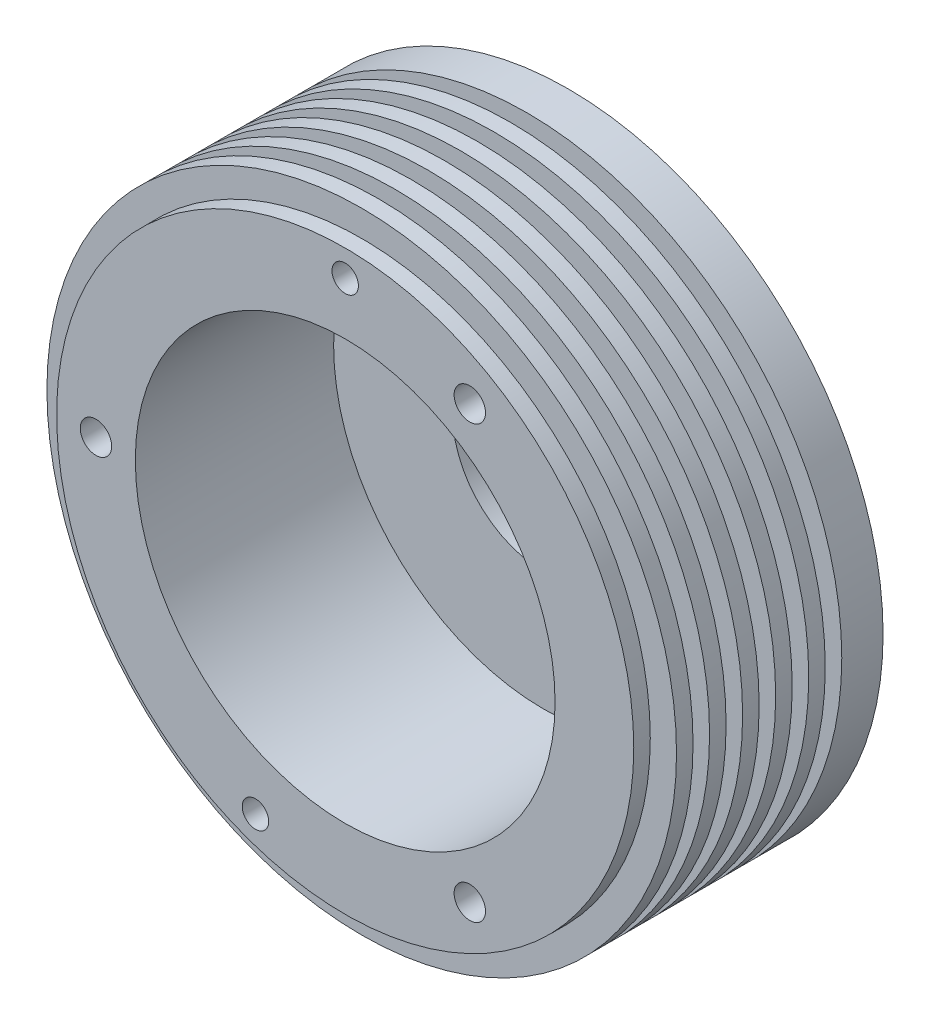
ISO-10303-21;
HEADER;
FILE_DESCRIPTION(('STEP AP214'),'2;1');
FILE_NAME('part.step','',(''),(''),'','','');
FILE_SCHEMA(('AUTOMOTIVE_DESIGN { 1 0 10303 214 1 1 1 1 }'));
ENDSEC;
DATA;
#1=APPLICATION_CONTEXT('core data for automotive mechanical design processes');
#2=APPLICATION_PROTOCOL_DEFINITION('international standard','automotive_design',2000,#1);
#3=PRODUCT_CONTEXT('',#1,'mechanical');
#4=PRODUCT('Part','Part','',(#3));
#5=PRODUCT_RELATED_PRODUCT_CATEGORY('part','',(#4));
#6=PRODUCT_DEFINITION_FORMATION('','',#4);
#7=PRODUCT_DEFINITION_CONTEXT('part definition',#1,'design');
#8=PRODUCT_DEFINITION('design','',#6,#7);
#9=PRODUCT_DEFINITION_SHAPE('','',#8);
#10=(LENGTH_UNIT() NAMED_UNIT(*) SI_UNIT(.MILLI.,.METRE.));
#11=(NAMED_UNIT(*) PLANE_ANGLE_UNIT() SI_UNIT($,.RADIAN.));
#12=(NAMED_UNIT(*) SI_UNIT($,.STERADIAN.) SOLID_ANGLE_UNIT());
#13=UNCERTAINTY_MEASURE_WITH_UNIT(LENGTH_MEASURE(1.E-05),#10,'distance_accuracy_value','');
#14=(GEOMETRIC_REPRESENTATION_CONTEXT(3) GLOBAL_UNCERTAINTY_ASSIGNED_CONTEXT((#13)) GLOBAL_UNIT_ASSIGNED_CONTEXT((#10,
#11,#12)) REPRESENTATION_CONTEXT('',''));
#15=CARTESIAN_POINT('',(0.,0.,0.));
#16=DIRECTION('',(0.,0.,1.));
#17=DIRECTION('',(1.,0.,0.));
#18=AXIS2_PLACEMENT_3D('',#15,#16,#17);
#19=CARTESIAN_POINT('',(23.6795038759268,29.6707036517637,27.));
#20=DIRECTION('',(0.,0.,-1.));
#21=DIRECTION('',(-1.,0.,0.));
#22=AXIS2_PLACEMENT_3D('',#19,#20,#21);
#23=CYLINDRICAL_SURFACE('',#22,38.1);
#24=CARTESIAN_POINT('',(23.6795038759268,29.6707036517637,0.));
#25=DIRECTION('',(0.,0.,1.));
#26=DIRECTION('',(1.,0.,0.));
#27=AXIS2_PLACEMENT_3D('',#24,#25,#26);
#28=CIRCLE('',#27,38.1);
#29=CARTESIAN_POINT('',(61.7795038759268,29.6707036517637,0.));
#30=VERTEX_POINT('',#29);
#31=EDGE_CURVE('E11',#30,#30,#28,.T.);
#32=ORIENTED_EDGE('',*,*,#31,.T.);
#33=EDGE_LOOP('',(#32));
#34=FACE_BOUND('',#33,.T.);
#35=CARTESIAN_POINT('',(23.6795038759268,29.6707036517637,5.));
#36=DIRECTION('',(0.,0.,1.));
#37=DIRECTION('',(1.,0.,0.));
#38=AXIS2_PLACEMENT_3D('',#35,#36,#37);
#39=CIRCLE('',#38,38.1);
#40=CARTESIAN_POINT('',(61.7795038759268,29.6707036517637,5.));
#41=VERTEX_POINT('',#40);
#42=EDGE_CURVE('E84',#41,#41,#39,.T.);
#43=ORIENTED_EDGE('',*,*,#42,.F.);
#44=EDGE_LOOP('',(#43));
#45=FACE_BOUND('',#44,.T.);
#46=ADVANCED_FACE('F39',(#34,#45),#23,.T.);
#47=CARTESIAN_POINT('',(23.6795038759268,29.6707036517637,23.));
#48=DIRECTION('',(0.,0.,1.));
#49=DIRECTION('',(1.,0.,0.));
#50=AXIS2_PLACEMENT_3D('',#47,#48,#49);
#51=CIRCLE('',#50,38.1);
#52=CARTESIAN_POINT('',(61.7795038759268,29.6707036517637,23.));
#53=VERTEX_POINT('',#52);
#54=EDGE_CURVE('E146',#53,#53,#51,.T.);
#55=ORIENTED_EDGE('',*,*,#54,.T.);
#56=EDGE_LOOP('',(#55));
#57=FACE_BOUND('',#56,.T.);
#58=CARTESIAN_POINT('',(23.6795038759268,29.6707036517637,25.));
#59=DIRECTION('',(0.,0.,1.));
#60=DIRECTION('',(1.,0.,0.));
#61=AXIS2_PLACEMENT_3D('',#58,#59,#60);
#62=CIRCLE('',#61,38.1);
#63=CARTESIAN_POINT('',(61.7795038759268,29.6707036517637,25.));
#64=VERTEX_POINT('',#63);
#65=EDGE_CURVE('E67',#64,#64,#62,.T.);
#66=ORIENTED_EDGE('',*,*,#65,.F.);
#67=EDGE_LOOP('',(#66));
#68=FACE_BOUND('',#67,.T.);
#69=ADVANCED_FACE('F41',(#57,#68),#23,.T.);
#70=CARTESIAN_POINT('',(23.6795038759268,29.6707036517637,27.));
#71=DIRECTION('',(0.,0.,1.));
#72=DIRECTION('',(1.,0.,0.));
#73=AXIS2_PLACEMENT_3D('',#70,#71,#72);
#74=PLANE('',#73);
#75=CARTESIAN_POINT('',(23.6795038759268,61.4207036517637,27.));
#76=DIRECTION('',(0.,0.,1.));
#77=DIRECTION('',(1.,0.,0.));
#78=AXIS2_PLACEMENT_3D('',#75,#76,#77);
#79=CIRCLE('',#78,1.60019999999999);
#80=CARTESIAN_POINT('',(25.2797038759268,61.4207036517637,27.));
#81=VERTEX_POINT('',#80);
#82=EDGE_CURVE('E191',#81,#81,#79,.F.);
#83=ORIENTED_EDGE('',*,*,#82,.T.);
#84=EDGE_LOOP('',(#83));
#85=FACE_BOUND('',#84,.T.);
#86=CARTESIAN_POINT('',(12.8203643253369,-0.164537058188961,27.));
#87=DIRECTION('',(0.,0.,1.));
#88=DIRECTION('',(1.,0.,0.));
#89=AXIS2_PLACEMENT_3D('',#86,#87,#88);
#90=CIRCLE('',#89,1.60019999999999);
#91=CARTESIAN_POINT('',(14.4205643253369,-0.164537058188961,27.));
#92=VERTEX_POINT('',#91);
#93=EDGE_CURVE('E183',#92,#92,#90,.F.);
#94=ORIENTED_EDGE('',*,*,#93,.T.);
#95=EDGE_LOOP('',(#94));
#96=FACE_BOUND('',#95,.T.);
#97=CARTESIAN_POINT('',(38.7607538759265,55.792194893412,27.));
#98=DIRECTION('',(0.,0.,-1.));
#99=DIRECTION('',(-1.,0.,0.));
#100=AXIS2_PLACEMENT_3D('',#97,#98,#99);
#101=CIRCLE('',#100,1.89864999999999);
#102=CARTESIAN_POINT('',(36.8621038759265,55.792194893412,27.));
#103=VERTEX_POINT('',#102);
#104=EDGE_CURVE('E175',#103,#103,#101,.T.);
#105=ORIENTED_EDGE('',*,*,#104,.T.);
#106=EDGE_LOOP('',(#105));
#107=FACE_BOUND('',#106,.T.);
#108=CARTESIAN_POINT('',(-6.48299612407322,29.6707036517637,27.));
#109=DIRECTION('',(0.,0.,-1.));
#110=DIRECTION('',(-1.,0.,0.));
#111=AXIS2_PLACEMENT_3D('',#108,#109,#110);
#112=CIRCLE('',#111,1.89864999999999);
#113=CARTESIAN_POINT('',(-8.38164612407321,29.6707036517637,27.));
#114=VERTEX_POINT('',#113);
#115=EDGE_CURVE('E167',#114,#114,#112,.T.);
#116=ORIENTED_EDGE('',*,*,#115,.T.);
#117=EDGE_LOOP('',(#116));
#118=FACE_BOUND('',#117,.T.);
#119=CARTESIAN_POINT('',(38.7607538759269,3.54921241011561,27.));
#120=DIRECTION('',(0.,0.,-1.));
#121=DIRECTION('',(-1.,0.,0.));
#122=AXIS2_PLACEMENT_3D('',#119,#120,#121);
#123=CIRCLE('',#122,1.89864999999999);
#124=CARTESIAN_POINT('',(36.8621038759269,3.54921241011561,27.));
#125=VERTEX_POINT('',#124);
#126=EDGE_CURVE('E94',#125,#125,#123,.T.);
#127=ORIENTED_EDGE('',*,*,#126,.T.);
#128=EDGE_LOOP('',(#127));
#129=FACE_BOUND('',#128,.T.);
#130=CARTESIAN_POINT('',(23.6795038759268,29.6707036517637,27.));
#131=DIRECTION('',(0.,0.,1.));
#132=DIRECTION('',(1.,0.,0.));
#133=AXIS2_PLACEMENT_3D('',#130,#131,#132);
#134=CIRCLE('',#133,25.4);
#135=CARTESIAN_POINT('',(49.0795038759268,29.6707036517637,27.));
#136=VERTEX_POINT('',#135);
#137=EDGE_CURVE('E52',#136,#136,#134,.T.);
#138=ORIENTED_EDGE('',*,*,#137,.F.);
#139=EDGE_LOOP('',(#138));
#140=FACE_BOUND('',#139,.T.);
#141=CARTESIAN_POINT('',(23.6795038759268,29.6707036517637,27.));
#142=DIRECTION('',(0.,0.,1.));
#143=DIRECTION('',(1.,0.,0.));
#144=AXIS2_PLACEMENT_3D('',#141,#142,#143);
#145=CIRCLE('',#144,34.925);
#146=CARTESIAN_POINT('',(58.6045038759268,29.6707036517637,27.));
#147=VERTEX_POINT('',#146);
#148=EDGE_CURVE('E72',#147,#147,#145,.T.);
#149=ORIENTED_EDGE('',*,*,#148,.T.);
#150=EDGE_LOOP('',(#149));
#151=FACE_BOUND('',#150,.T.);
#152=ADVANCED_FACE('F206',(#85,#96,#107,#118,#129,#140,#151),#74,.T.);
#153=CARTESIAN_POINT('',(23.6795038759268,29.6707036517637,0.));
#154=DIRECTION('',(0.,0.,1.));
#155=DIRECTION('',(1.,0.,0.));
#156=AXIS2_PLACEMENT_3D('',#153,#154,#155);
#157=PLANE('',#156);
#158=CARTESIAN_POINT('',(23.6795038759268,61.4207036517637,0.));
#159=DIRECTION('',(0.,0.,-1.));
#160=DIRECTION('',(-1.,0.,0.));
#161=AXIS2_PLACEMENT_3D('',#158,#159,#160);
#162=CIRCLE('',#161,1.6002);
#163=CARTESIAN_POINT('',(22.0793038759268,61.4207036517637,0.));
#164=VERTEX_POINT('',#163);
#165=EDGE_CURVE('E195',#164,#164,#162,.T.);
#166=ORIENTED_EDGE('',*,*,#165,.F.);
#167=EDGE_LOOP('',(#166));
#168=FACE_BOUND('',#167,.T.);
#169=CARTESIAN_POINT('',(12.8203643253369,-0.164537058188961,0.));
#170=DIRECTION('',(0.,0.,-1.));
#171=DIRECTION('',(-1.,0.,0.));
#172=AXIS2_PLACEMENT_3D('',#169,#170,#171);
#173=CIRCLE('',#172,1.6002);
#174=CARTESIAN_POINT('',(11.2201643253369,-0.164537058188961,0.));
#175=VERTEX_POINT('',#174);
#176=EDGE_CURVE('E187',#175,#175,#173,.T.);
#177=ORIENTED_EDGE('',*,*,#176,.F.);
#178=EDGE_LOOP('',(#177));
#179=FACE_BOUND('',#178,.T.);
#180=CARTESIAN_POINT('',(38.7607538759265,55.792194893412,0.));
#181=DIRECTION('',(0.,0.,-1.));
#182=DIRECTION('',(-1.,0.,0.));
#183=AXIS2_PLACEMENT_3D('',#180,#181,#182);
#184=CIRCLE('',#183,1.89864999999999);
#185=CARTESIAN_POINT('',(36.8621038759265,55.792194893412,0.));
#186=VERTEX_POINT('',#185);
#187=EDGE_CURVE('E179',#186,#186,#184,.T.);
#188=ORIENTED_EDGE('',*,*,#187,.F.);
#189=EDGE_LOOP('',(#188));
#190=FACE_BOUND('',#189,.T.);
#191=CARTESIAN_POINT('',(-6.48299612407322,29.6707036517637,0.));
#192=DIRECTION('',(0.,0.,-1.));
#193=DIRECTION('',(-1.,0.,0.));
#194=AXIS2_PLACEMENT_3D('',#191,#192,#193);
#195=CIRCLE('',#194,1.89864999999999);
#196=CARTESIAN_POINT('',(-8.38164612407321,29.6707036517637,0.));
#197=VERTEX_POINT('',#196);
#198=EDGE_CURVE('E171',#197,#197,#195,.T.);
#199=ORIENTED_EDGE('',*,*,#198,.F.);
#200=EDGE_LOOP('',(#199));
#201=FACE_BOUND('',#200,.T.);
#202=CARTESIAN_POINT('',(38.7607538759269,3.54921241011561,0.));
#203=DIRECTION('',(0.,0.,-1.));
#204=DIRECTION('',(-1.,0.,0.));
#205=AXIS2_PLACEMENT_3D('',#202,#203,#204);
#206=CIRCLE('',#205,1.89864999999999);
#207=CARTESIAN_POINT('',(36.8621038759269,3.54921241011561,0.));
#208=VERTEX_POINT('',#207);
#209=EDGE_CURVE('E163',#208,#208,#206,.T.);
#210=ORIENTED_EDGE('',*,*,#209,.F.);
#211=EDGE_LOOP('',(#210));
#212=FACE_BOUND('',#211,.T.);
#213=CARTESIAN_POINT('',(23.6795038759268,29.6707036517637,0.));
#214=DIRECTION('',(0.,0.,-1.));
#215=DIRECTION('',(-1.,0.,0.));
#216=AXIS2_PLACEMENT_3D('',#213,#214,#215);
#217=CIRCLE('',#216,11.);
#218=CARTESIAN_POINT('',(12.6795038759268,29.6707036517637,0.));
#219=VERTEX_POINT('',#218);
#220=EDGE_CURVE('E63',#219,#219,#217,.T.);
#221=ORIENTED_EDGE('',*,*,#220,.F.);
#222=EDGE_LOOP('',(#221));
#223=FACE_BOUND('',#222,.T.);
#224=ORIENTED_EDGE('',*,*,#31,.F.);
#225=EDGE_LOOP('',(#224));
#226=FACE_BOUND('',#225,.T.);
#227=ADVANCED_FACE('F202',(#168,#179,#190,#201,#212,#223,#226),#157,.F.);
#228=CARTESIAN_POINT('',(23.6795038759268,29.6707036517637,-71.8420489685532));
#229=DIRECTION('',(0.,0.,1.));
#230=DIRECTION('',(1.,0.,0.));
#231=AXIS2_PLACEMENT_3D('',#228,#229,#230);
#232=CYLINDRICAL_SURFACE('',#231,25.4);
#233=CARTESIAN_POINT('',(23.6795038759268,29.6707036517637,3.));
#234=DIRECTION('',(0.,0.,1.));
#235=DIRECTION('',(1.,0.,0.));
#236=AXIS2_PLACEMENT_3D('',#233,#234,#235);
#237=CIRCLE('',#236,25.4);
#238=CARTESIAN_POINT('',(49.0795038759268,29.6707036517637,3.));
#239=VERTEX_POINT('',#238);
#240=EDGE_CURVE('E47',#239,#239,#237,.F.);
#241=ORIENTED_EDGE('',*,*,#240,.T.);
#242=EDGE_LOOP('',(#241));
#243=FACE_BOUND('',#242,.T.);
#244=ORIENTED_EDGE('',*,*,#137,.T.);
#245=EDGE_LOOP('',(#244));
#246=FACE_BOUND('',#245,.T.);
#247=ADVANCED_FACE('F205',(#243,#246),#232,.F.);
#248=CARTESIAN_POINT('',(23.6795038759268,29.6707036517637,3.));
#249=DIRECTION('',(0.,0.,1.));
#250=DIRECTION('',(1.,0.,0.));
#251=AXIS2_PLACEMENT_3D('',#248,#249,#250);
#252=PLANE('',#251);
#253=CARTESIAN_POINT('',(23.6795038759268,29.6707036517637,3.));
#254=DIRECTION('',(0.,0.,1.));
#255=DIRECTION('',(1.,0.,0.));
#256=AXIS2_PLACEMENT_3D('',#253,#254,#255);
#257=CIRCLE('',#256,11.);
#258=CARTESIAN_POINT('',(34.6795038759268,29.6707036517637,3.));
#259=VERTEX_POINT('',#258);
#260=EDGE_CURVE('E57',#259,#259,#257,.F.);
#261=ORIENTED_EDGE('',*,*,#260,.T.);
#262=EDGE_LOOP('',(#261));
#263=FACE_BOUND('',#262,.T.);
#264=ORIENTED_EDGE('',*,*,#240,.F.);
#265=EDGE_LOOP('',(#264));
#266=FACE_BOUND('',#265,.T.);
#267=ADVANCED_FACE('F222',(#263,#266),#252,.T.);
#268=CARTESIAN_POINT('',(23.6795038759268,29.6707036517637,34.1126983722081));
#269=DIRECTION('',(0.,0.,-1.));
#270=DIRECTION('',(-1.,0.,0.));
#271=AXIS2_PLACEMENT_3D('',#268,#269,#270);
#272=CYLINDRICAL_SURFACE('',#271,11.);
#273=ORIENTED_EDGE('',*,*,#220,.T.);
#274=EDGE_LOOP('',(#273));
#275=FACE_BOUND('',#274,.T.);
#276=ORIENTED_EDGE('',*,*,#260,.F.);
#277=EDGE_LOOP('',(#276));
#278=FACE_BOUND('',#277,.T.);
#279=ADVANCED_FACE('F218',(#275,#278),#272,.F.);
#280=CARTESIAN_POINT('',(23.6795038759268,29.6707036517637,25.));
#281=DIRECTION('',(0.,0.,1.));
#282=DIRECTION('',(1.,0.,0.));
#283=AXIS2_PLACEMENT_3D('',#280,#281,#282);
#284=PLANE('',#283);
#285=CARTESIAN_POINT('',(23.6795038759268,29.6707036517637,25.));
#286=DIRECTION('',(0.,0.,1.));
#287=DIRECTION('',(1.,0.,0.));
#288=AXIS2_PLACEMENT_3D('',#285,#286,#287);
#289=CIRCLE('',#288,34.925);
#290=CARTESIAN_POINT('',(58.6045038759268,29.6707036517637,25.));
#291=VERTEX_POINT('',#290);
#292=EDGE_CURVE('E71',#291,#291,#289,.T.);
#293=ORIENTED_EDGE('',*,*,#292,.F.);
#294=EDGE_LOOP('',(#293));
#295=FACE_BOUND('',#294,.T.);
#296=ORIENTED_EDGE('',*,*,#65,.T.);
#297=EDGE_LOOP('',(#296));
#298=FACE_BOUND('',#297,.T.);
#299=ADVANCED_FACE('F221',(#295,#298),#284,.T.);
#300=CARTESIAN_POINT('',(23.6795038759268,29.6707036517637,25.));
#301=DIRECTION('',(0.,0.,1.));
#302=DIRECTION('',(1.,0.,0.));
#303=AXIS2_PLACEMENT_3D('',#300,#301,#302);
#304=CYLINDRICAL_SURFACE('',#303,34.925);
#305=ORIENTED_EDGE('',*,*,#292,.T.);
#306=EDGE_LOOP('',(#305));
#307=FACE_BOUND('',#306,.T.);
#308=ORIENTED_EDGE('',*,*,#148,.F.);
#309=EDGE_LOOP('',(#308));
#310=FACE_BOUND('',#309,.T.);
#311=ADVANCED_FACE('F304',(#307,#310),#304,.T.);
#312=CARTESIAN_POINT('',(23.6795038759268,29.6707036517637,5.));
#313=DIRECTION('',(0.,0.,1.));
#314=DIRECTION('',(1.,0.,0.));
#315=AXIS2_PLACEMENT_3D('',#312,#313,#314);
#316=PLANE('',#315);
#317=CARTESIAN_POINT('',(23.6795038759268,29.6707036517637,5.));
#318=DIRECTION('',(0.,0.,1.));
#319=DIRECTION('',(1.,0.,0.));
#320=AXIS2_PLACEMENT_3D('',#317,#318,#319);
#321=CIRCLE('',#320,34.925);
#322=CARTESIAN_POINT('',(58.6045038759268,29.6707036517637,5.));
#323=VERTEX_POINT('',#322);
#324=EDGE_CURVE('E85',#323,#323,#321,.T.);
#325=ORIENTED_EDGE('',*,*,#324,.F.);
#326=EDGE_LOOP('',(#325));
#327=FACE_BOUND('',#326,.T.);
#328=ORIENTED_EDGE('',*,*,#42,.T.);
#329=EDGE_LOOP('',(#328));
#330=FACE_BOUND('',#329,.T.);
#331=ADVANCED_FACE('F301',(#327,#330),#316,.T.);
#332=CARTESIAN_POINT('',(23.6795038759268,29.6707036517637,7.));
#333=DIRECTION('',(0.,0.,1.));
#334=DIRECTION('',(1.,0.,0.));
#335=AXIS2_PLACEMENT_3D('',#332,#333,#334);
#336=PLANE('',#335);
#337=CARTESIAN_POINT('',(23.6795038759268,29.6707036517637,7.));
#338=DIRECTION('',(0.,0.,1.));
#339=DIRECTION('',(1.,0.,0.));
#340=AXIS2_PLACEMENT_3D('',#337,#338,#339);
#341=CIRCLE('',#340,34.925);
#342=CARTESIAN_POINT('',(58.6045038759268,29.6707036517637,7.));
#343=VERTEX_POINT('',#342);
#344=EDGE_CURVE('E90',#343,#343,#341,.T.);
#345=ORIENTED_EDGE('',*,*,#344,.T.);
#346=EDGE_LOOP('',(#345));
#347=FACE_BOUND('',#346,.T.);
#348=CARTESIAN_POINT('',(23.6795038759268,29.6707036517637,7.));
#349=DIRECTION('',(0.,0.,1.));
#350=DIRECTION('',(1.,0.,0.));
#351=AXIS2_PLACEMENT_3D('',#348,#349,#350);
#352=CIRCLE('',#351,38.1);
#353=CARTESIAN_POINT('',(61.7795038759268,29.6707036517637,7.));
#354=VERTEX_POINT('',#353);
#355=EDGE_CURVE('E80',#354,#354,#352,.T.);
#356=ORIENTED_EDGE('',*,*,#355,.F.);
#357=EDGE_LOOP('',(#356));
#358=FACE_BOUND('',#357,.T.);
#359=ADVANCED_FACE('F299',(#347,#358),#336,.F.);
#360=CARTESIAN_POINT('',(23.6795038759268,29.6707036517637,5.));
#361=DIRECTION('',(0.,0.,1.));
#362=DIRECTION('',(1.,0.,0.));
#363=AXIS2_PLACEMENT_3D('',#360,#361,#362);
#364=CYLINDRICAL_SURFACE('',#363,34.925);
#365=ORIENTED_EDGE('',*,*,#324,.T.);
#366=EDGE_LOOP('',(#365));
#367=FACE_BOUND('',#366,.T.);
#368=ORIENTED_EDGE('',*,*,#344,.F.);
#369=EDGE_LOOP('',(#368));
#370=FACE_BOUND('',#369,.T.);
#371=ADVANCED_FACE('F295',(#367,#370),#364,.T.);
#372=CARTESIAN_POINT('',(23.6795038759268,29.6707036517637,21.));
#373=DIRECTION('',(0.,0.,1.));
#374=DIRECTION('',(1.,0.,0.));
#375=AXIS2_PLACEMENT_3D('',#372,#373,#374);
#376=PLANE('',#375);
#377=CARTESIAN_POINT('',(23.6795038759268,29.6707036517637,21.));
#378=DIRECTION('',(0.,0.,1.));
#379=DIRECTION('',(1.,0.,0.));
#380=AXIS2_PLACEMENT_3D('',#377,#378,#379);
#381=CIRCLE('',#380,34.925);
#382=CARTESIAN_POINT('',(58.6045038759268,29.6707036517637,21.));
#383=VERTEX_POINT('',#382);
#384=EDGE_CURVE('E150',#383,#383,#381,.T.);
#385=ORIENTED_EDGE('',*,*,#384,.F.);
#386=EDGE_LOOP('',(#385));
#387=FACE_BOUND('',#386,.T.);
#388=CARTESIAN_POINT('',(23.6795038759268,29.6707036517637,21.));
#389=DIRECTION('',(0.,0.,1.));
#390=DIRECTION('',(1.,0.,0.));
#391=AXIS2_PLACEMENT_3D('',#388,#389,#390);
#392=CIRCLE('',#391,38.1);
#393=CARTESIAN_POINT('',(61.7795038759268,29.6707036517637,21.));
#394=VERTEX_POINT('',#393);
#395=EDGE_CURVE('E76',#394,#394,#392,.T.);
#396=ORIENTED_EDGE('',*,*,#395,.T.);
#397=EDGE_LOOP('',(#396));
#398=FACE_BOUND('',#397,.T.);
#399=ADVANCED_FACE('F298',(#387,#398),#376,.T.);
#400=CARTESIAN_POINT('',(23.6795038759268,29.6707036517637,23.));
#401=DIRECTION('',(0.,0.,1.));
#402=DIRECTION('',(1.,0.,0.));
#403=AXIS2_PLACEMENT_3D('',#400,#401,#402);
#404=PLANE('',#403);
#405=CARTESIAN_POINT('',(23.6795038759268,29.6707036517637,23.));
#406=DIRECTION('',(0.,0.,1.));
#407=DIRECTION('',(1.,0.,0.));
#408=AXIS2_PLACEMENT_3D('',#405,#406,#407);
#409=CIRCLE('',#408,34.925);
#410=CARTESIAN_POINT('',(58.6045038759268,29.6707036517637,23.));
#411=VERTEX_POINT('',#410);
#412=EDGE_CURVE('E139',#411,#411,#409,.T.);
#413=ORIENTED_EDGE('',*,*,#412,.T.);
#414=EDGE_LOOP('',(#413));
#415=FACE_BOUND('',#414,.T.);
#416=ORIENTED_EDGE('',*,*,#54,.F.);
#417=EDGE_LOOP('',(#416));
#418=FACE_BOUND('',#417,.T.);
#419=ADVANCED_FACE('F253',(#415,#418),#404,.F.);
#420=CARTESIAN_POINT('',(23.6795038759268,29.6707036517637,21.));
#421=DIRECTION('',(0.,0.,1.));
#422=DIRECTION('',(1.,0.,0.));
#423=AXIS2_PLACEMENT_3D('',#420,#421,#422);
#424=CYLINDRICAL_SURFACE('',#423,34.925);
#425=ORIENTED_EDGE('',*,*,#384,.T.);
#426=EDGE_LOOP('',(#425));
#427=FACE_BOUND('',#426,.T.);
#428=ORIENTED_EDGE('',*,*,#412,.F.);
#429=EDGE_LOOP('',(#428));
#430=FACE_BOUND('',#429,.T.);
#431=ADVANCED_FACE('F243',(#427,#430),#424,.T.);
#432=ORIENTED_EDGE('',*,*,#355,.T.);
#433=EDGE_LOOP('',(#432));
#434=FACE_BOUND('',#433,.T.);
#435=CARTESIAN_POINT('',(23.6795038759268,29.6707036517637,9.));
#436=DIRECTION('',(0.,0.,1.));
#437=DIRECTION('',(1.,0.,0.));
#438=AXIS2_PLACEMENT_3D('',#435,#436,#437);
#439=CIRCLE('',#438,38.1);
#440=CARTESIAN_POINT('',(61.7795038759268,29.6707036517637,9.));
#441=VERTEX_POINT('',#440);
#442=EDGE_CURVE('E102',#441,#441,#439,.T.);
#443=ORIENTED_EDGE('',*,*,#442,.F.);
#444=EDGE_LOOP('',(#443));
#445=FACE_BOUND('',#444,.T.);
#446=ADVANCED_FACE('F234',(#434,#445),#23,.T.);
#447=CARTESIAN_POINT('',(23.6795038759268,29.6707036517637,9.));
#448=DIRECTION('',(0.,0.,1.));
#449=DIRECTION('',(1.,0.,0.));
#450=AXIS2_PLACEMENT_3D('',#447,#448,#449);
#451=PLANE('',#450);
#452=CARTESIAN_POINT('',(23.6795038759268,29.6707036517637,9.));
#453=DIRECTION('',(0.,0.,1.));
#454=DIRECTION('',(1.,0.,0.));
#455=AXIS2_PLACEMENT_3D('',#452,#453,#454);
#456=CIRCLE('',#455,34.925);
#457=CARTESIAN_POINT('',(58.6045038759268,29.6707036517637,9.));
#458=VERTEX_POINT('',#457);
#459=EDGE_CURVE('E103',#458,#458,#456,.T.);
#460=ORIENTED_EDGE('',*,*,#459,.F.);
#461=EDGE_LOOP('',(#460));
#462=FACE_BOUND('',#461,.T.);
#463=ORIENTED_EDGE('',*,*,#442,.T.);
#464=EDGE_LOOP('',(#463));
#465=FACE_BOUND('',#464,.T.);
#466=ADVANCED_FACE('F242',(#462,#465),#451,.T.);
#467=CARTESIAN_POINT('',(23.6795038759268,29.6707036517637,11.));
#468=DIRECTION('',(0.,0.,1.));
#469=DIRECTION('',(1.,0.,0.));
#470=AXIS2_PLACEMENT_3D('',#467,#468,#469);
#471=PLANE('',#470);
#472=CARTESIAN_POINT('',(23.6795038759268,29.6707036517637,11.));
#473=DIRECTION('',(0.,0.,1.));
#474=DIRECTION('',(1.,0.,0.));
#475=AXIS2_PLACEMENT_3D('',#472,#473,#474);
#476=CIRCLE('',#475,34.925);
#477=CARTESIAN_POINT('',(58.6045038759268,29.6707036517637,11.));
#478=VERTEX_POINT('',#477);
#479=EDGE_CURVE('E89',#478,#478,#476,.T.);
#480=ORIENTED_EDGE('',*,*,#479,.T.);
#481=EDGE_LOOP('',(#480));
#482=FACE_BOUND('',#481,.T.);
#483=CARTESIAN_POINT('',(23.6795038759268,29.6707036517637,11.));
#484=DIRECTION('',(0.,0.,1.));
#485=DIRECTION('',(1.,0.,0.));
#486=AXIS2_PLACEMENT_3D('',#483,#484,#485);
#487=CIRCLE('',#486,38.1);
#488=CARTESIAN_POINT('',(61.7795038759268,29.6707036517637,11.));
#489=VERTEX_POINT('',#488);
#490=EDGE_CURVE('E98',#489,#489,#487,.T.);
#491=ORIENTED_EDGE('',*,*,#490,.F.);
#492=EDGE_LOOP('',(#491));
#493=FACE_BOUND('',#492,.T.);
#494=ADVANCED_FACE('F250',(#482,#493),#471,.F.);
#495=CARTESIAN_POINT('',(23.6795038759268,29.6707036517637,9.));
#496=DIRECTION('',(0.,0.,1.));
#497=DIRECTION('',(1.,0.,0.));
#498=AXIS2_PLACEMENT_3D('',#495,#496,#497);
#499=CYLINDRICAL_SURFACE('',#498,34.925);
#500=ORIENTED_EDGE('',*,*,#459,.T.);
#501=EDGE_LOOP('',(#500));
#502=FACE_BOUND('',#501,.T.);
#503=ORIENTED_EDGE('',*,*,#479,.F.);
#504=EDGE_LOOP('',(#503));
#505=FACE_BOUND('',#504,.T.);
#506=ADVANCED_FACE('F288',(#502,#505),#499,.T.);
#507=CARTESIAN_POINT('',(23.6795038759268,29.6707036517637,19.));
#508=DIRECTION('',(0.,0.,1.));
#509=DIRECTION('',(1.,0.,0.));
#510=AXIS2_PLACEMENT_3D('',#507,#508,#509);
#511=CIRCLE('',#510,38.1);
#512=CARTESIAN_POINT('',(61.7795038759268,29.6707036517637,19.));
#513=VERTEX_POINT('',#512);
#514=EDGE_CURVE('E130',#513,#513,#511,.T.);
#515=ORIENTED_EDGE('',*,*,#514,.T.);
#516=EDGE_LOOP('',(#515));
#517=FACE_BOUND('',#516,.T.);
#518=ORIENTED_EDGE('',*,*,#395,.F.);
#519=EDGE_LOOP('',(#518));
#520=FACE_BOUND('',#519,.T.);
#521=ADVANCED_FACE('F239',(#517,#520),#23,.T.);
#522=CARTESIAN_POINT('',(23.6795038759268,29.6707036517637,17.));
#523=DIRECTION('',(0.,0.,1.));
#524=DIRECTION('',(1.,0.,0.));
#525=AXIS2_PLACEMENT_3D('',#522,#523,#524);
#526=PLANE('',#525);
#527=CARTESIAN_POINT('',(23.6795038759268,29.6707036517637,17.));
#528=DIRECTION('',(0.,0.,1.));
#529=DIRECTION('',(1.,0.,0.));
#530=AXIS2_PLACEMENT_3D('',#527,#528,#529);
#531=CIRCLE('',#530,34.925);
#532=CARTESIAN_POINT('',(58.6045038759268,29.6707036517637,17.));
#533=VERTEX_POINT('',#532);
#534=EDGE_CURVE('E135',#533,#533,#531,.T.);
#535=ORIENTED_EDGE('',*,*,#534,.F.);
#536=EDGE_LOOP('',(#535));
#537=FACE_BOUND('',#536,.T.);
#538=CARTESIAN_POINT('',(23.6795038759268,29.6707036517637,17.));
#539=DIRECTION('',(0.,0.,1.));
#540=DIRECTION('',(1.,0.,0.));
#541=AXIS2_PLACEMENT_3D('',#538,#539,#540);
#542=CIRCLE('',#541,38.1);
#543=CARTESIAN_POINT('',(61.7795038759268,29.6707036517637,17.));
#544=VERTEX_POINT('',#543);
#545=EDGE_CURVE('E134',#544,#544,#542,.T.);
#546=ORIENTED_EDGE('',*,*,#545,.T.);
#547=EDGE_LOOP('',(#546));
#548=FACE_BOUND('',#547,.T.);
#549=ADVANCED_FACE('F362',(#537,#548),#526,.T.);
#550=CARTESIAN_POINT('',(23.6795038759268,29.6707036517637,19.));
#551=DIRECTION('',(0.,0.,1.));
#552=DIRECTION('',(1.,0.,0.));
#553=AXIS2_PLACEMENT_3D('',#550,#551,#552);
#554=PLANE('',#553);
#555=CARTESIAN_POINT('',(23.6795038759268,29.6707036517637,19.));
#556=DIRECTION('',(0.,0.,1.));
#557=DIRECTION('',(1.,0.,0.));
#558=AXIS2_PLACEMENT_3D('',#555,#556,#557);
#559=CIRCLE('',#558,34.925);
#560=CARTESIAN_POINT('',(58.6045038759268,29.6707036517637,19.));
#561=VERTEX_POINT('',#560);
#562=EDGE_CURVE('E123',#561,#561,#559,.T.);
#563=ORIENTED_EDGE('',*,*,#562,.T.);
#564=EDGE_LOOP('',(#563));
#565=FACE_BOUND('',#564,.T.);
#566=ORIENTED_EDGE('',*,*,#514,.F.);
#567=EDGE_LOOP('',(#566));
#568=FACE_BOUND('',#567,.T.);
#569=ADVANCED_FACE('F267',(#565,#568),#554,.F.);
#570=CARTESIAN_POINT('',(23.6795038759268,29.6707036517637,17.));
#571=DIRECTION('',(0.,0.,1.));
#572=DIRECTION('',(1.,0.,0.));
#573=AXIS2_PLACEMENT_3D('',#570,#571,#572);
#574=CYLINDRICAL_SURFACE('',#573,34.925);
#575=ORIENTED_EDGE('',*,*,#534,.T.);
#576=EDGE_LOOP('',(#575));
#577=FACE_BOUND('',#576,.T.);
#578=ORIENTED_EDGE('',*,*,#562,.F.);
#579=EDGE_LOOP('',(#578));
#580=FACE_BOUND('',#579,.T.);
#581=ADVANCED_FACE('F259',(#577,#580),#574,.T.);
#582=ORIENTED_EDGE('',*,*,#490,.T.);
#583=EDGE_LOOP('',(#582));
#584=FACE_BOUND('',#583,.T.);
#585=CARTESIAN_POINT('',(23.6795038759268,29.6707036517637,13.));
#586=DIRECTION('',(0.,0.,1.));
#587=DIRECTION('',(1.,0.,0.));
#588=AXIS2_PLACEMENT_3D('',#585,#586,#587);
#589=CIRCLE('',#588,38.1);
#590=CARTESIAN_POINT('',(61.7795038759268,29.6707036517637,13.));
#591=VERTEX_POINT('',#590);
#592=EDGE_CURVE('E118',#591,#591,#589,.T.);
#593=ORIENTED_EDGE('',*,*,#592,.F.);
#594=EDGE_LOOP('',(#593));
#595=FACE_BOUND('',#594,.T.);
#596=ADVANCED_FACE('F245',(#584,#595),#23,.T.);
#597=CARTESIAN_POINT('',(23.6795038759268,29.6707036517637,15.));
#598=DIRECTION('',(0.,0.,1.));
#599=DIRECTION('',(1.,0.,0.));
#600=AXIS2_PLACEMENT_3D('',#597,#598,#599);
#601=CIRCLE('',#600,38.1);
#602=CARTESIAN_POINT('',(61.7795038759268,29.6707036517637,15.));
#603=VERTEX_POINT('',#602);
#604=EDGE_CURVE('E114',#603,#603,#601,.T.);
#605=ORIENTED_EDGE('',*,*,#604,.T.);
#606=EDGE_LOOP('',(#605));
#607=FACE_BOUND('',#606,.T.);
#608=ORIENTED_EDGE('',*,*,#545,.F.);
#609=EDGE_LOOP('',(#608));
#610=FACE_BOUND('',#609,.T.);
#611=ADVANCED_FACE('F258',(#607,#610),#23,.T.);
#612=CARTESIAN_POINT('',(23.6795038759268,29.6707036517637,13.));
#613=DIRECTION('',(0.,0.,1.));
#614=DIRECTION('',(1.,0.,0.));
#615=AXIS2_PLACEMENT_3D('',#612,#613,#614);
#616=PLANE('',#615);
#617=CARTESIAN_POINT('',(23.6795038759268,29.6707036517637,13.));
#618=DIRECTION('',(0.,0.,1.));
#619=DIRECTION('',(1.,0.,0.));
#620=AXIS2_PLACEMENT_3D('',#617,#618,#619);
#621=CIRCLE('',#620,34.925);
#622=CARTESIAN_POINT('',(58.6045038759268,29.6707036517637,13.));
#623=VERTEX_POINT('',#622);
#624=EDGE_CURVE('E119',#623,#623,#621,.T.);
#625=ORIENTED_EDGE('',*,*,#624,.F.);
#626=EDGE_LOOP('',(#625));
#627=FACE_BOUND('',#626,.T.);
#628=ORIENTED_EDGE('',*,*,#592,.T.);
#629=EDGE_LOOP('',(#628));
#630=FACE_BOUND('',#629,.T.);
#631=ADVANCED_FACE('F265',(#627,#630),#616,.T.);
#632=CARTESIAN_POINT('',(23.6795038759268,29.6707036517637,15.));
#633=DIRECTION('',(0.,0.,1.));
#634=DIRECTION('',(1.,0.,0.));
#635=AXIS2_PLACEMENT_3D('',#632,#633,#634);
#636=PLANE('',#635);
#637=CARTESIAN_POINT('',(23.6795038759268,29.6707036517637,15.));
#638=DIRECTION('',(0.,0.,1.));
#639=DIRECTION('',(1.,0.,0.));
#640=AXIS2_PLACEMENT_3D('',#637,#638,#639);
#641=CIRCLE('',#640,34.925);
#642=CARTESIAN_POINT('',(58.6045038759268,29.6707036517637,15.));
#643=VERTEX_POINT('',#642);
#644=EDGE_CURVE('E107',#643,#643,#641,.T.);
#645=ORIENTED_EDGE('',*,*,#644,.T.);
#646=EDGE_LOOP('',(#645));
#647=FACE_BOUND('',#646,.T.);
#648=ORIENTED_EDGE('',*,*,#604,.F.);
#649=EDGE_LOOP('',(#648));
#650=FACE_BOUND('',#649,.T.);
#651=ADVANCED_FACE('F275',(#647,#650),#636,.F.);
#652=CARTESIAN_POINT('',(23.6795038759268,29.6707036517637,13.));
#653=DIRECTION('',(0.,0.,1.));
#654=DIRECTION('',(1.,0.,0.));
#655=AXIS2_PLACEMENT_3D('',#652,#653,#654);
#656=CYLINDRICAL_SURFACE('',#655,34.925);
#657=ORIENTED_EDGE('',*,*,#624,.T.);
#658=EDGE_LOOP('',(#657));
#659=FACE_BOUND('',#658,.T.);
#660=ORIENTED_EDGE('',*,*,#644,.F.);
#661=EDGE_LOOP('',(#660));
#662=FACE_BOUND('',#661,.T.);
#663=ADVANCED_FACE('F281',(#659,#662),#656,.T.);
#664=CARTESIAN_POINT('',(38.7607538759269,3.54921241011561,0.));
#665=DIRECTION('',(0.,0.,-1.));
#666=DIRECTION('',(-1.,0.,0.));
#667=AXIS2_PLACEMENT_3D('',#664,#665,#666);
#668=CYLINDRICAL_SURFACE('',#667,1.89864999999999);
#669=ORIENTED_EDGE('',*,*,#126,.F.);
#670=EDGE_LOOP('',(#669));
#671=FACE_BOUND('',#670,.T.);
#672=ORIENTED_EDGE('',*,*,#209,.T.);
#673=EDGE_LOOP('',(#672));
#674=FACE_BOUND('',#673,.T.);
#675=ADVANCED_FACE('F341',(#671,#674),#668,.F.);
#676=CARTESIAN_POINT('',(-6.48299612407322,29.6707036517637,0.));
#677=DIRECTION('',(0.,0.,-1.));
#678=DIRECTION('',(-1.,0.,0.));
#679=AXIS2_PLACEMENT_3D('',#676,#677,#678);
#680=CYLINDRICAL_SURFACE('',#679,1.89864999999999);
#681=ORIENTED_EDGE('',*,*,#115,.F.);
#682=EDGE_LOOP('',(#681));
#683=FACE_BOUND('',#682,.T.);
#684=ORIENTED_EDGE('',*,*,#198,.T.);
#685=EDGE_LOOP('',(#684));
#686=FACE_BOUND('',#685,.T.);
#687=ADVANCED_FACE('F344',(#683,#686),#680,.F.);
#688=CARTESIAN_POINT('',(38.7607538759265,55.792194893412,0.));
#689=DIRECTION('',(0.,0.,-1.));
#690=DIRECTION('',(-1.,0.,0.));
#691=AXIS2_PLACEMENT_3D('',#688,#689,#690);
#692=CYLINDRICAL_SURFACE('',#691,1.89864999999999);
#693=ORIENTED_EDGE('',*,*,#104,.F.);
#694=EDGE_LOOP('',(#693));
#695=FACE_BOUND('',#694,.T.);
#696=ORIENTED_EDGE('',*,*,#187,.T.);
#697=EDGE_LOOP('',(#696));
#698=FACE_BOUND('',#697,.T.);
#699=ADVANCED_FACE('F350',(#695,#698),#692,.F.);
#700=CARTESIAN_POINT('',(12.8203643253369,-0.164537058188961,0.));
#701=DIRECTION('',(0.,0.,-1.));
#702=DIRECTION('',(-1.,0.,0.));
#703=AXIS2_PLACEMENT_3D('',#700,#701,#702);
#704=CYLINDRICAL_SURFACE('',#703,1.60019999999999);
#705=ORIENTED_EDGE('',*,*,#93,.F.);
#706=EDGE_LOOP('',(#705));
#707=FACE_BOUND('',#706,.T.);
#708=ORIENTED_EDGE('',*,*,#176,.T.);
#709=EDGE_LOOP('',(#708));
#710=FACE_BOUND('',#709,.T.);
#711=ADVANCED_FACE('F441',(#707,#710),#704,.F.);
#712=CARTESIAN_POINT('',(23.6795038759268,61.4207036517637,0.));
#713=DIRECTION('',(0.,0.,-1.));
#714=DIRECTION('',(-1.,0.,0.));
#715=AXIS2_PLACEMENT_3D('',#712,#713,#714);
#716=CYLINDRICAL_SURFACE('',#715,1.60019999999999);
#717=ORIENTED_EDGE('',*,*,#82,.F.);
#718=EDGE_LOOP('',(#717));
#719=FACE_BOUND('',#718,.T.);
#720=ORIENTED_EDGE('',*,*,#165,.T.);
#721=EDGE_LOOP('',(#720));
#722=FACE_BOUND('',#721,.T.);
#723=ADVANCED_FACE('F200',(#719,#722),#716,.F.);
#724=CLOSED_SHELL('',(#46,#69,#152,#227,#247,#267,#279,#299,#311,#331,#359,#371,#399,#419,#431,
#446,#466,#494,#506,#521,#549,#569,#581,#596,#611,#631,#651,#663,#675,#687,#699,#711,#723));
#725=MANIFOLD_SOLID_BREP('B2',#724);
#726=ADVANCED_BREP_SHAPE_REPRESENTATION('',(#18,#725),#14);
#727=SHAPE_DEFINITION_REPRESENTATION(#9,#726);
ENDSEC;
END-ISO-10303-21;
